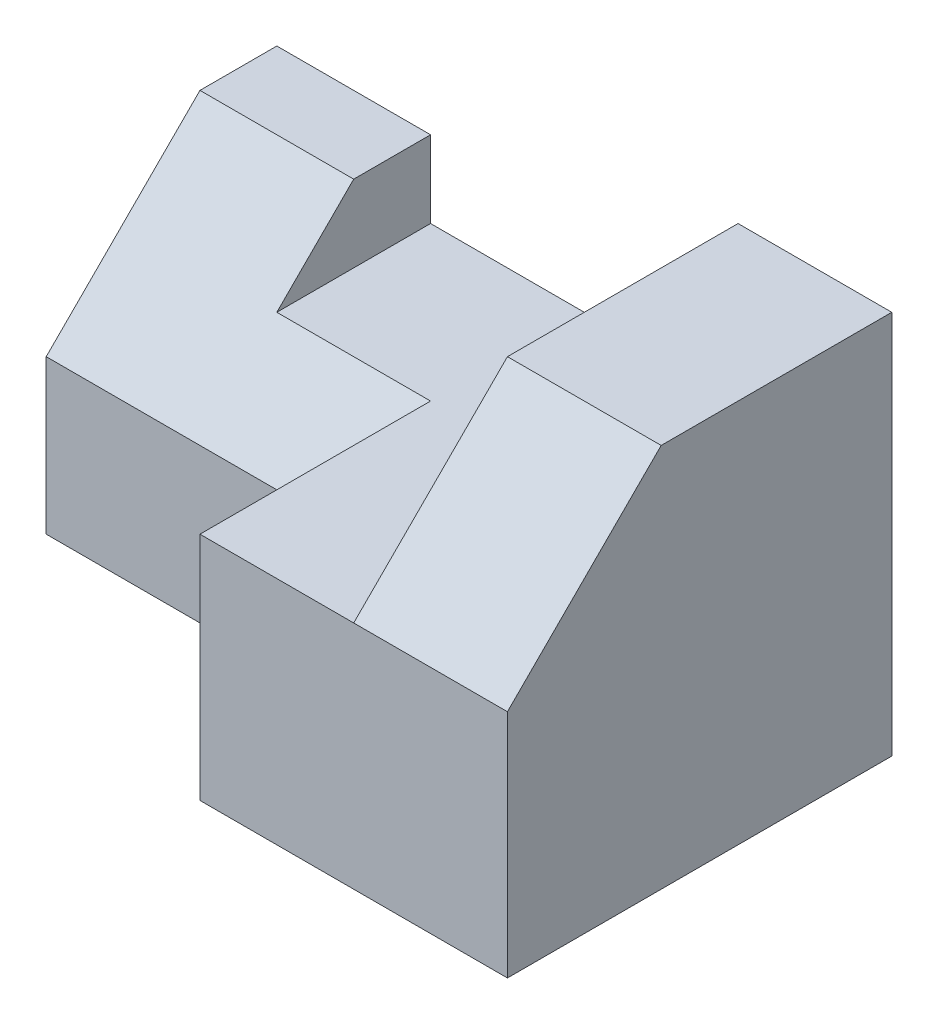
ISO-10303-21;
HEADER;
FILE_DESCRIPTION(('STEP AP214'),'2;1');
FILE_NAME('part.step','',(''),(''),'','','');
FILE_SCHEMA(('AUTOMOTIVE_DESIGN { 1 0 10303 214 1 1 1 1 }'));
ENDSEC;
DATA;
#1=APPLICATION_CONTEXT('core data for automotive mechanical design processes');
#2=APPLICATION_PROTOCOL_DEFINITION('international standard','automotive_design',2000,#1);
#3=PRODUCT_CONTEXT('',#1,'mechanical');
#4=PRODUCT('Part','Part','',(#3));
#5=PRODUCT_RELATED_PRODUCT_CATEGORY('part','',(#4));
#6=PRODUCT_DEFINITION_FORMATION('','',#4);
#7=PRODUCT_DEFINITION_CONTEXT('part definition',#1,'design');
#8=PRODUCT_DEFINITION('design','',#6,#7);
#9=PRODUCT_DEFINITION_SHAPE('','',#8);
#10=(LENGTH_UNIT() NAMED_UNIT(*) SI_UNIT(.MILLI.,.METRE.));
#11=(NAMED_UNIT(*) PLANE_ANGLE_UNIT() SI_UNIT($,.RADIAN.));
#12=(NAMED_UNIT(*) SI_UNIT($,.STERADIAN.) SOLID_ANGLE_UNIT());
#13=UNCERTAINTY_MEASURE_WITH_UNIT(LENGTH_MEASURE(1.E-05),#10,'distance_accuracy_value','');
#14=(GEOMETRIC_REPRESENTATION_CONTEXT(3) GLOBAL_UNCERTAINTY_ASSIGNED_CONTEXT((#13)) GLOBAL_UNIT_ASSIGNED_CONTEXT((#10,
#11,#12)) REPRESENTATION_CONTEXT('',''));
#15=CARTESIAN_POINT('',(0.,0.,0.));
#16=DIRECTION('',(0.,0.,1.));
#17=DIRECTION('',(1.,0.,0.));
#18=AXIS2_PLACEMENT_3D('',#15,#16,#17);
#19=CARTESIAN_POINT('',(0.,30.,0.));
#20=DIRECTION('',(0.,-1.,0.));
#21=DIRECTION('',(0.,0.,-1.));
#22=AXIS2_PLACEMENT_3D('',#19,#20,#21);
#23=PLANE('',#22);
#24=DIRECTION('',(0.,0.,-1.));
#25=VECTOR('',#24,1.);
#26=CARTESIAN_POINT('',(20.,30.,0.));
#27=LINE('',#26,#25);
#28=CARTESIAN_POINT('',(20.,30.,-30.));
#29=VERTEX_POINT('',#28);
#30=CARTESIAN_POINT('',(20.,30.,-50.));
#31=VERTEX_POINT('',#30);
#32=EDGE_CURVE('E54',#29,#31,#27,.T.);
#33=ORIENTED_EDGE('',*,*,#32,.F.);
#34=DIRECTION('',(-1.,0.,0.));
#35=VECTOR('',#34,1.);
#36=CARTESIAN_POINT('',(40.,30.,-30.));
#37=LINE('',#36,#35);
#38=CARTESIAN_POINT('',(40.,30.,-30.));
#39=VERTEX_POINT('',#38);
#40=EDGE_CURVE('E126',#39,#29,#37,.T.);
#41=ORIENTED_EDGE('',*,*,#40,.F.);
#42=DIRECTION('',(0.,0.,-1.));
#43=VECTOR('',#42,1.);
#44=CARTESIAN_POINT('',(40.,30.,0.));
#45=LINE('',#44,#43);
#46=CARTESIAN_POINT('',(40.,30.,0.));
#47=VERTEX_POINT('',#46);
#48=EDGE_CURVE('E184',#47,#39,#45,.T.);
#49=ORIENTED_EDGE('',*,*,#48,.F.);
#50=DIRECTION('',(1.,0.,0.));
#51=VECTOR('',#50,1.);
#52=CARTESIAN_POINT('',(0.,30.,0.));
#53=LINE('',#52,#51);
#54=CARTESIAN_POINT('',(60.,30.,0.));
#55=VERTEX_POINT('',#54);
#56=EDGE_CURVE('E205',#47,#55,#53,.T.);
#57=ORIENTED_EDGE('',*,*,#56,.T.);
#58=DIRECTION('',(0.,0.,1.));
#59=VECTOR('',#58,1.);
#60=CARTESIAN_POINT('',(60.,30.,-50.));
#61=LINE('',#60,#59);
#62=CARTESIAN_POINT('',(60.,30.,-50.));
#63=VERTEX_POINT('',#62);
#64=EDGE_CURVE('E162',#63,#55,#61,.T.);
#65=ORIENTED_EDGE('',*,*,#64,.F.);
#66=DIRECTION('',(-1.,0.,0.));
#67=VECTOR('',#66,1.);
#68=CARTESIAN_POINT('',(0.,30.,-50.));
#69=LINE('',#68,#67);
#70=EDGE_CURVE('E50',#63,#31,#69,.T.);
#71=ORIENTED_EDGE('',*,*,#70,.T.);
#72=EDGE_LOOP('',(#33,#41,#49,#57,#65,#71));
#73=FACE_BOUND('',#72,.T.);
#74=ADVANCED_FACE('F33',(#73),#23,.F.);
#75=CARTESIAN_POINT('',(0.,30.,0.));
#76=DIRECTION('',(1.,0.,0.));
#77=DIRECTION('',(0.,0.,-1.));
#78=AXIS2_PLACEMENT_3D('',#75,#76,#77);
#79=PLANE('',#78);
#80=DIRECTION('',(0.,1.,0.));
#81=VECTOR('',#80,1.);
#82=CARTESIAN_POINT('',(0.,0.,-20.));
#83=LINE('',#82,#81);
#84=CARTESIAN_POINT('',(0.,0.,-20.));
#85=VERTEX_POINT('',#84);
#86=CARTESIAN_POINT('',(0.,20.,-20.));
#87=VERTEX_POINT('',#86);
#88=EDGE_CURVE('E226',#85,#87,#83,.T.);
#89=ORIENTED_EDGE('',*,*,#88,.T.);
#90=DIRECTION('',(0.,-0.707106781186548,0.707106781186547));
#91=VECTOR('',#90,1.);
#92=CARTESIAN_POINT('',(0.,30.,-30.));
#93=LINE('',#92,#91);
#94=CARTESIAN_POINT('',(0.,40.,-40.));
#95=VERTEX_POINT('',#94);
#96=EDGE_CURVE('E149',#95,#87,#93,.T.);
#97=ORIENTED_EDGE('',*,*,#96,.F.);
#98=DIRECTION('',(0.,0.,-1.));
#99=VECTOR('',#98,1.);
#100=CARTESIAN_POINT('',(0.,40.,-50.));
#101=LINE('',#100,#99);
#102=CARTESIAN_POINT('',(0.,40.,-50.));
#103=VERTEX_POINT('',#102);
#104=EDGE_CURVE('E137',#95,#103,#101,.T.);
#105=ORIENTED_EDGE('',*,*,#104,.T.);
#106=DIRECTION('',(0.,-1.,0.));
#107=VECTOR('',#106,1.);
#108=CARTESIAN_POINT('',(0.,30.,-50.));
#109=LINE('',#108,#107);
#110=CARTESIAN_POINT('',(0.,0.,-50.));
#111=VERTEX_POINT('',#110);
#112=EDGE_CURVE('E204',#103,#111,#109,.T.);
#113=ORIENTED_EDGE('',*,*,#112,.T.);
#114=DIRECTION('',(0.,0.,1.));
#115=VECTOR('',#114,1.);
#116=CARTESIAN_POINT('',(0.,0.,0.));
#117=LINE('',#116,#115);
#118=EDGE_CURVE('E222',#111,#85,#117,.T.);
#119=ORIENTED_EDGE('',*,*,#118,.T.);
#120=EDGE_LOOP('',(#89,#97,#105,#113,#119));
#121=FACE_BOUND('',#120,.T.);
#122=ADVANCED_FACE('F35',(#121),#79,.F.);
#123=CARTESIAN_POINT('',(0.,30.,0.));
#124=DIRECTION('',(0.,0.,-1.));
#125=DIRECTION('',(-1.,0.,0.));
#126=AXIS2_PLACEMENT_3D('',#123,#124,#125);
#127=PLANE('',#126);
#128=DIRECTION('',(0.,-1.,0.));
#129=VECTOR('',#128,1.);
#130=CARTESIAN_POINT('',(80.,30.,0.));
#131=LINE('',#130,#129);
#132=CARTESIAN_POINT('',(80.,30.,0.));
#133=VERTEX_POINT('',#132);
#134=CARTESIAN_POINT('',(80.,0.,0.));
#135=VERTEX_POINT('',#134);
#136=EDGE_CURVE('E11',#133,#135,#131,.T.);
#137=ORIENTED_EDGE('',*,*,#136,.F.);
#138=DIRECTION('',(1.,0.,0.));
#139=VECTOR('',#138,1.);
#140=CARTESIAN_POINT('',(60.,30.,0.));
#141=LINE('',#140,#139);
#142=EDGE_CURVE('E163',#55,#133,#141,.T.);
#143=ORIENTED_EDGE('',*,*,#142,.F.);
#144=ORIENTED_EDGE('',*,*,#56,.F.);
#145=DIRECTION('',(0.,1.,0.));
#146=VECTOR('',#145,1.);
#147=CARTESIAN_POINT('',(40.,0.,0.));
#148=LINE('',#147,#146);
#149=CARTESIAN_POINT('',(40.,0.,0.));
#150=VERTEX_POINT('',#149);
#151=EDGE_CURVE('E218',#150,#47,#148,.T.);
#152=ORIENTED_EDGE('',*,*,#151,.F.);
#153=DIRECTION('',(1.,0.,0.));
#154=VECTOR('',#153,1.);
#155=CARTESIAN_POINT('',(0.,0.,0.));
#156=LINE('',#155,#154);
#157=EDGE_CURVE('E225',#150,#135,#156,.T.);
#158=ORIENTED_EDGE('',*,*,#157,.T.);
#159=EDGE_LOOP('',(#137,#143,#144,#152,#158));
#160=FACE_BOUND('',#159,.T.);
#161=ADVANCED_FACE('F254',(#160),#127,.F.);
#162=CARTESIAN_POINT('',(80.,30.,0.));
#163=DIRECTION('',(-1.,0.,0.));
#164=DIRECTION('',(0.,0.,1.));
#165=AXIS2_PLACEMENT_3D('',#162,#163,#164);
#166=PLANE('',#165);
#167=DIRECTION('',(0.,0.,-1.));
#168=VECTOR('',#167,1.);
#169=CARTESIAN_POINT('',(80.,50.,-50.));
#170=LINE('',#169,#168);
#171=CARTESIAN_POINT('',(80.,50.,-20.));
#172=VERTEX_POINT('',#171);
#173=CARTESIAN_POINT('',(80.,50.,-50.));
#174=VERTEX_POINT('',#173);
#175=EDGE_CURVE('E164',#172,#174,#170,.T.);
#176=ORIENTED_EDGE('',*,*,#175,.F.);
#177=DIRECTION('',(0.,0.707106781186548,-0.707106781186548));
#178=VECTOR('',#177,1.);
#179=CARTESIAN_POINT('',(80.,50.,-20.));
#180=LINE('',#179,#178);
#181=EDGE_CURVE('E155',#133,#172,#180,.T.);
#182=ORIENTED_EDGE('',*,*,#181,.F.);
#183=ORIENTED_EDGE('',*,*,#136,.T.);
#184=DIRECTION('',(0.,0.,-1.));
#185=VECTOR('',#184,1.);
#186=CARTESIAN_POINT('',(80.,0.,0.));
#187=LINE('',#186,#185);
#188=CARTESIAN_POINT('',(80.,0.,-50.));
#189=VERTEX_POINT('',#188);
#190=EDGE_CURVE('E212',#135,#189,#187,.T.);
#191=ORIENTED_EDGE('',*,*,#190,.T.);
#192=DIRECTION('',(0.,-1.,0.));
#193=VECTOR('',#192,1.);
#194=CARTESIAN_POINT('',(80.,30.,-50.));
#195=LINE('',#194,#193);
#196=EDGE_CURVE('E42',#174,#189,#195,.T.);
#197=ORIENTED_EDGE('',*,*,#196,.F.);
#198=EDGE_LOOP('',(#176,#182,#183,#191,#197));
#199=FACE_BOUND('',#198,.T.);
#200=ADVANCED_FACE('F257',(#199),#166,.F.);
#201=CARTESIAN_POINT('',(0.,30.,-50.));
#202=DIRECTION('',(0.,0.,1.));
#203=DIRECTION('',(1.,0.,0.));
#204=AXIS2_PLACEMENT_3D('',#201,#202,#203);
#205=PLANE('',#204);
#206=ORIENTED_EDGE('',*,*,#112,.F.);
#207=DIRECTION('',(-1.,0.,0.));
#208=VECTOR('',#207,1.);
#209=CARTESIAN_POINT('',(20.,40.,-50.));
#210=LINE('',#209,#208);
#211=CARTESIAN_POINT('',(20.,40.,-50.));
#212=VERTEX_POINT('',#211);
#213=EDGE_CURVE('E138',#212,#103,#210,.T.);
#214=ORIENTED_EDGE('',*,*,#213,.F.);
#215=DIRECTION('',(0.,-1.,0.));
#216=VECTOR('',#215,1.);
#217=CARTESIAN_POINT('',(20.,30.,-50.));
#218=LINE('',#217,#216);
#219=EDGE_CURVE('E130',#212,#31,#218,.T.);
#220=ORIENTED_EDGE('',*,*,#219,.T.);
#221=ORIENTED_EDGE('',*,*,#70,.F.);
#222=DIRECTION('',(0.,-1.,0.));
#223=VECTOR('',#222,1.);
#224=CARTESIAN_POINT('',(60.,50.,-50.));
#225=LINE('',#224,#223);
#226=CARTESIAN_POINT('',(60.,50.,-50.));
#227=VERTEX_POINT('',#226);
#228=EDGE_CURVE('E171',#227,#63,#225,.T.);
#229=ORIENTED_EDGE('',*,*,#228,.F.);
#230=DIRECTION('',(-1.,0.,0.));
#231=VECTOR('',#230,1.);
#232=CARTESIAN_POINT('',(80.,50.,-50.));
#233=LINE('',#232,#231);
#234=EDGE_CURVE('E166',#174,#227,#233,.T.);
#235=ORIENTED_EDGE('',*,*,#234,.F.);
#236=ORIENTED_EDGE('',*,*,#196,.T.);
#237=DIRECTION('',(-1.,0.,0.));
#238=VECTOR('',#237,1.);
#239=CARTESIAN_POINT('',(0.,0.,-50.));
#240=LINE('',#239,#238);
#241=EDGE_CURVE('E209',#189,#111,#240,.T.);
#242=ORIENTED_EDGE('',*,*,#241,.T.);
#243=EDGE_LOOP('',(#206,#214,#220,#221,#229,#235,#236,#242));
#244=FACE_BOUND('',#243,.T.);
#245=ADVANCED_FACE('F203',(#244),#205,.F.);
#246=CARTESIAN_POINT('',(0.,0.,0.));
#247=DIRECTION('',(0.,-1.,0.));
#248=DIRECTION('',(0.,0.,-1.));
#249=AXIS2_PLACEMENT_3D('',#246,#247,#248);
#250=PLANE('',#249);
#251=ORIENTED_EDGE('',*,*,#118,.F.);
#252=ORIENTED_EDGE('',*,*,#241,.F.);
#253=ORIENTED_EDGE('',*,*,#190,.F.);
#254=ORIENTED_EDGE('',*,*,#157,.F.);
#255=DIRECTION('',(0.,0.,-1.));
#256=VECTOR('',#255,1.);
#257=CARTESIAN_POINT('',(40.,0.,0.));
#258=LINE('',#257,#256);
#259=CARTESIAN_POINT('',(40.,0.,-20.));
#260=VERTEX_POINT('',#259);
#261=EDGE_CURVE('E174',#150,#260,#258,.T.);
#262=ORIENTED_EDGE('',*,*,#261,.T.);
#263=DIRECTION('',(-1.,0.,0.));
#264=VECTOR('',#263,1.);
#265=CARTESIAN_POINT('',(0.,0.,-20.));
#266=LINE('',#265,#264);
#267=EDGE_CURVE('E237',#260,#85,#266,.T.);
#268=ORIENTED_EDGE('',*,*,#267,.T.);
#269=EDGE_LOOP('',(#251,#252,#253,#254,#262,#268));
#270=FACE_BOUND('',#269,.T.);
#271=ADVANCED_FACE('F234',(#270),#250,.T.);
#272=CARTESIAN_POINT('',(0.,0.,-20.));
#273=DIRECTION('',(0.,0.,-1.));
#274=DIRECTION('',(-1.,0.,0.));
#275=AXIS2_PLACEMENT_3D('',#272,#273,#274);
#276=PLANE('',#275);
#277=ORIENTED_EDGE('',*,*,#88,.F.);
#278=ORIENTED_EDGE('',*,*,#267,.F.);
#279=DIRECTION('',(0.,1.,0.));
#280=VECTOR('',#279,1.);
#281=CARTESIAN_POINT('',(40.,0.,-20.));
#282=LINE('',#281,#280);
#283=CARTESIAN_POINT('',(40.,20.,-20.));
#284=VERTEX_POINT('',#283);
#285=EDGE_CURVE('E245',#260,#284,#282,.T.);
#286=ORIENTED_EDGE('',*,*,#285,.T.);
#287=DIRECTION('',(-1.,0.,0.));
#288=VECTOR('',#287,1.);
#289=CARTESIAN_POINT('',(40.,20.,-20.));
#290=LINE('',#289,#288);
#291=EDGE_CURVE('E153',#284,#87,#290,.T.);
#292=ORIENTED_EDGE('',*,*,#291,.T.);
#293=EDGE_LOOP('',(#277,#278,#286,#292));
#294=FACE_BOUND('',#293,.T.);
#295=ADVANCED_FACE('F246',(#294),#276,.F.);
#296=CARTESIAN_POINT('',(40.,0.,0.));
#297=DIRECTION('',(1.,0.,0.));
#298=DIRECTION('',(0.,0.,-1.));
#299=AXIS2_PLACEMENT_3D('',#296,#297,#298);
#300=PLANE('',#299);
#301=ORIENTED_EDGE('',*,*,#48,.T.);
#302=DIRECTION('',(0.,-0.707106781186548,0.707106781186547));
#303=VECTOR('',#302,1.);
#304=CARTESIAN_POINT('',(40.,30.,-30.));
#305=LINE('',#304,#303);
#306=EDGE_CURVE('E150',#39,#284,#305,.T.);
#307=ORIENTED_EDGE('',*,*,#306,.T.);
#308=ORIENTED_EDGE('',*,*,#285,.F.);
#309=ORIENTED_EDGE('',*,*,#261,.F.);
#310=ORIENTED_EDGE('',*,*,#151,.T.);
#311=EDGE_LOOP('',(#301,#307,#308,#309,#310));
#312=FACE_BOUND('',#311,.T.);
#313=ADVANCED_FACE('F251',(#312),#300,.F.);
#314=CARTESIAN_POINT('',(60.,50.,-50.));
#315=DIRECTION('',(1.,0.,0.));
#316=DIRECTION('',(0.,0.,-1.));
#317=AXIS2_PLACEMENT_3D('',#314,#315,#316);
#318=PLANE('',#317);
#319=ORIENTED_EDGE('',*,*,#64,.T.);
#320=DIRECTION('',(0.,0.707106781186548,-0.707106781186548));
#321=VECTOR('',#320,1.);
#322=CARTESIAN_POINT('',(60.,50.,-20.));
#323=LINE('',#322,#321);
#324=CARTESIAN_POINT('',(60.,50.,-20.));
#325=VERTEX_POINT('',#324);
#326=EDGE_CURVE('E158',#55,#325,#323,.T.);
#327=ORIENTED_EDGE('',*,*,#326,.T.);
#328=DIRECTION('',(0.,0.,1.));
#329=VECTOR('',#328,1.);
#330=CARTESIAN_POINT('',(60.,50.,-50.));
#331=LINE('',#330,#329);
#332=EDGE_CURVE('E168',#227,#325,#331,.T.);
#333=ORIENTED_EDGE('',*,*,#332,.F.);
#334=ORIENTED_EDGE('',*,*,#228,.T.);
#335=EDGE_LOOP('',(#319,#327,#333,#334));
#336=FACE_BOUND('',#335,.T.);
#337=ADVANCED_FACE('F192',(#336),#318,.F.);
#338=CARTESIAN_POINT('',(0.,50.,0.));
#339=DIRECTION('',(0.,-1.,0.));
#340=DIRECTION('',(0.,0.,-1.));
#341=AXIS2_PLACEMENT_3D('',#338,#339,#340);
#342=PLANE('',#341);
#343=ORIENTED_EDGE('',*,*,#332,.T.);
#344=DIRECTION('',(1.,0.,0.));
#345=VECTOR('',#344,1.);
#346=CARTESIAN_POINT('',(60.,50.,-20.));
#347=LINE('',#346,#345);
#348=EDGE_CURVE('E159',#325,#172,#347,.T.);
#349=ORIENTED_EDGE('',*,*,#348,.T.);
#350=ORIENTED_EDGE('',*,*,#175,.T.);
#351=ORIENTED_EDGE('',*,*,#234,.T.);
#352=EDGE_LOOP('',(#343,#349,#350,#351));
#353=FACE_BOUND('',#352,.T.);
#354=ADVANCED_FACE('F196',(#353),#342,.F.);
#355=CARTESIAN_POINT('',(60.,50.,-20.));
#356=DIRECTION('',(0.,-0.707106781186548,-0.707106781186548));
#357=DIRECTION('',(0.,0.707106781186548,-0.707106781186548));
#358=AXIS2_PLACEMENT_3D('',#355,#356,#357);
#359=PLANE('',#358);
#360=ORIENTED_EDGE('',*,*,#181,.T.);
#361=ORIENTED_EDGE('',*,*,#348,.F.);
#362=ORIENTED_EDGE('',*,*,#326,.F.);
#363=ORIENTED_EDGE('',*,*,#142,.T.);
#364=EDGE_LOOP('',(#360,#361,#362,#363));
#365=FACE_BOUND('',#364,.T.);
#366=ADVANCED_FACE('F256',(#365),#359,.F.);
#367=CARTESIAN_POINT('',(40.,30.,-30.));
#368=DIRECTION('',(0.,-0.707106781186547,-0.707106781186548));
#369=DIRECTION('',(0.,0.707106781186548,-0.707106781186547));
#370=AXIS2_PLACEMENT_3D('',#367,#368,#369);
#371=PLANE('',#370);
#372=ORIENTED_EDGE('',*,*,#96,.T.);
#373=ORIENTED_EDGE('',*,*,#291,.F.);
#374=ORIENTED_EDGE('',*,*,#306,.F.);
#375=ORIENTED_EDGE('',*,*,#40,.T.);
#376=DIRECTION('',(0.,0.707106781186548,-0.707106781186547));
#377=VECTOR('',#376,1.);
#378=CARTESIAN_POINT('',(20.,20.,-20.));
#379=LINE('',#378,#377);
#380=CARTESIAN_POINT('',(20.,40.,-40.));
#381=VERTEX_POINT('',#380);
#382=EDGE_CURVE('E119',#29,#381,#379,.T.);
#383=ORIENTED_EDGE('',*,*,#382,.T.);
#384=DIRECTION('',(-1.,0.,0.));
#385=VECTOR('',#384,1.);
#386=CARTESIAN_POINT('',(20.,40.,-40.));
#387=LINE('',#386,#385);
#388=EDGE_CURVE('E123',#381,#95,#387,.T.);
#389=ORIENTED_EDGE('',*,*,#388,.T.);
#390=EDGE_LOOP('',(#372,#373,#374,#375,#383,#389));
#391=FACE_BOUND('',#390,.T.);
#392=ADVANCED_FACE('F122',(#391),#371,.F.);
#393=CARTESIAN_POINT('',(20.,0.,0.));
#394=DIRECTION('',(-1.,0.,0.));
#395=DIRECTION('',(0.,0.,1.));
#396=AXIS2_PLACEMENT_3D('',#393,#394,#395);
#397=PLANE('',#396);
#398=ORIENTED_EDGE('',*,*,#382,.F.);
#399=ORIENTED_EDGE('',*,*,#32,.T.);
#400=ORIENTED_EDGE('',*,*,#219,.F.);
#401=DIRECTION('',(0.,0.,-1.));
#402=VECTOR('',#401,1.);
#403=CARTESIAN_POINT('',(20.,40.,-50.));
#404=LINE('',#403,#402);
#405=EDGE_CURVE('E129',#381,#212,#404,.T.);
#406=ORIENTED_EDGE('',*,*,#405,.F.);
#407=EDGE_LOOP('',(#398,#399,#400,#406));
#408=FACE_BOUND('',#407,.T.);
#409=ADVANCED_FACE('F140',(#408),#397,.F.);
#410=CARTESIAN_POINT('',(20.,40.,-50.));
#411=DIRECTION('',(0.,1.,0.));
#412=DIRECTION('',(0.,0.,1.));
#413=AXIS2_PLACEMENT_3D('',#410,#411,#412);
#414=PLANE('',#413);
#415=ORIENTED_EDGE('',*,*,#104,.F.);
#416=ORIENTED_EDGE('',*,*,#388,.F.);
#417=ORIENTED_EDGE('',*,*,#405,.T.);
#418=ORIENTED_EDGE('',*,*,#213,.T.);
#419=EDGE_LOOP('',(#415,#416,#417,#418));
#420=FACE_BOUND('',#419,.T.);
#421=ADVANCED_FACE('F134',(#420),#414,.T.);
#422=CLOSED_SHELL('',(#74,#122,#161,#200,#245,#271,#295,#313,#337,#354,#366,#392,#409,#421));
#423=MANIFOLD_SOLID_BREP('B2',#422);
#424=ADVANCED_BREP_SHAPE_REPRESENTATION('',(#18,#423),#14);
#425=SHAPE_DEFINITION_REPRESENTATION(#9,#424);
ENDSEC;
END-ISO-10303-21;
